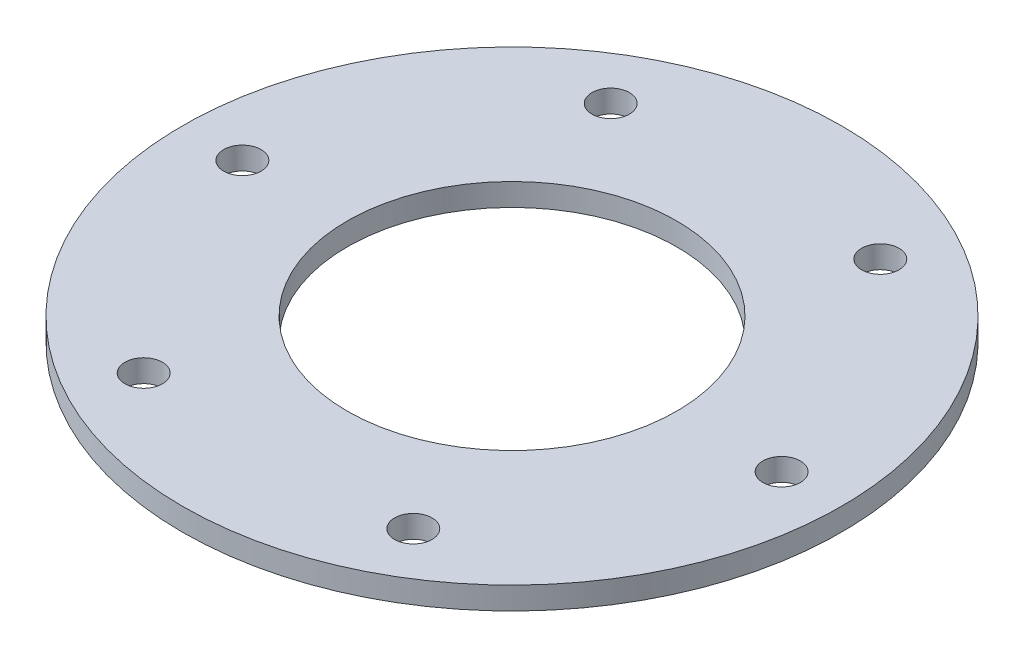
ISO-10303-21;
HEADER;
FILE_DESCRIPTION(('STEP AP214'),'2;1');
FILE_NAME('part.step','',(''),(''),'','','');
FILE_SCHEMA(('AUTOMOTIVE_DESIGN { 1 0 10303 214 1 1 1 1 }'));
ENDSEC;
DATA;
#1=APPLICATION_CONTEXT('core data for automotive mechanical design processes');
#2=APPLICATION_PROTOCOL_DEFINITION('international standard','automotive_design',2000,#1);
#3=PRODUCT_CONTEXT('',#1,'mechanical');
#4=PRODUCT('Part','Part','',(#3));
#5=PRODUCT_RELATED_PRODUCT_CATEGORY('part','',(#4));
#6=PRODUCT_DEFINITION_FORMATION('','',#4);
#7=PRODUCT_DEFINITION_CONTEXT('part definition',#1,'design');
#8=PRODUCT_DEFINITION('design','',#6,#7);
#9=PRODUCT_DEFINITION_SHAPE('','',#8);
#10=(LENGTH_UNIT() NAMED_UNIT(*) SI_UNIT(.MILLI.,.METRE.));
#11=(NAMED_UNIT(*) PLANE_ANGLE_UNIT() SI_UNIT($,.RADIAN.));
#12=(NAMED_UNIT(*) SI_UNIT($,.STERADIAN.) SOLID_ANGLE_UNIT());
#13=UNCERTAINTY_MEASURE_WITH_UNIT(LENGTH_MEASURE(1.E-05),#10,'distance_accuracy_value','');
#14=(GEOMETRIC_REPRESENTATION_CONTEXT(3) GLOBAL_UNCERTAINTY_ASSIGNED_CONTEXT((#13)) GLOBAL_UNIT_ASSIGNED_CONTEXT((#10,
#11,#12)) REPRESENTATION_CONTEXT('',''));
#15=CARTESIAN_POINT('',(0.,0.,0.));
#16=DIRECTION('',(0.,0.,1.));
#17=DIRECTION('',(1.,0.,0.));
#18=AXIS2_PLACEMENT_3D('',#15,#16,#17);
#19=CARTESIAN_POINT('',(-63.1888963600962,9.525,-128.089070315984));
#20=DIRECTION('',(0.,1.,0.));
#21=DIRECTION('',(0.,0.,1.));
#22=AXIS2_PLACEMENT_3D('',#19,#20,#21);
#23=PLANE('',#22);
#24=CARTESIAN_POINT('',(51.1111036399038,9.525,-128.089070315984));
#25=DIRECTION('',(0.,1.,0.));
#26=DIRECTION('',(0.,0.,1.));
#27=AXIS2_PLACEMENT_3D('',#24,#25,#26);
#28=CIRCLE('',#27,7.93749999999999);
#29=CARTESIAN_POINT('',(51.1111036399038,9.525,-120.151570315984));
#30=VERTEX_POINT('',#29);
#31=EDGE_CURVE('E79',#30,#30,#28,.T.);
#32=ORIENTED_EDGE('',*,*,#31,.F.);
#33=EDGE_LOOP('',(#32));
#34=FACE_BOUND('',#33,.T.);
#35=CARTESIAN_POINT('',(-6.03889636009618,9.525,-29.1023666634226));
#36=DIRECTION('',(0.,1.,0.));
#37=DIRECTION('',(0.,0.,1.));
#38=AXIS2_PLACEMENT_3D('',#35,#36,#37);
#39=CIRCLE('',#38,7.9375);
#40=CARTESIAN_POINT('',(-6.03889636009618,9.525,-21.1648666634226));
#41=VERTEX_POINT('',#40);
#42=EDGE_CURVE('E84',#41,#41,#39,.T.);
#43=ORIENTED_EDGE('',*,*,#42,.F.);
#44=EDGE_LOOP('',(#43));
#45=FACE_BOUND('',#44,.T.);
#46=CARTESIAN_POINT('',(-120.338896360096,9.525,-29.1023666634225));
#47=DIRECTION('',(0.,1.,0.));
#48=DIRECTION('',(0.,0.,1.));
#49=AXIS2_PLACEMENT_3D('',#46,#47,#48);
#50=CIRCLE('',#49,7.93749999999999);
#51=CARTESIAN_POINT('',(-120.338896360096,9.525,-21.1648666634225));
#52=VERTEX_POINT('',#51);
#53=EDGE_CURVE('E60',#52,#52,#50,.T.);
#54=ORIENTED_EDGE('',*,*,#53,.F.);
#55=EDGE_LOOP('',(#54));
#56=FACE_BOUND('',#55,.T.);
#57=CARTESIAN_POINT('',(-177.488896360096,9.525,-128.089070315984));
#58=DIRECTION('',(0.,1.,0.));
#59=DIRECTION('',(0.,0.,1.));
#60=AXIS2_PLACEMENT_3D('',#57,#58,#59);
#61=CIRCLE('',#60,7.93750000000001);
#62=CARTESIAN_POINT('',(-177.488896360096,9.525,-120.151570315984));
#63=VERTEX_POINT('',#62);
#64=EDGE_CURVE('E59',#63,#63,#61,.T.);
#65=ORIENTED_EDGE('',*,*,#64,.F.);
#66=EDGE_LOOP('',(#65));
#67=FACE_BOUND('',#66,.T.);
#68=CARTESIAN_POINT('',(-120.338896360096,9.525,-227.075773968545));
#69=DIRECTION('',(0.,1.,0.));
#70=DIRECTION('',(0.,0.,1.));
#71=AXIS2_PLACEMENT_3D('',#68,#69,#70);
#72=CIRCLE('',#71,7.93749999999999);
#73=CARTESIAN_POINT('',(-120.338896360096,9.525,-219.138273968545));
#74=VERTEX_POINT('',#73);
#75=EDGE_CURVE('E67',#74,#74,#72,.T.);
#76=ORIENTED_EDGE('',*,*,#75,.F.);
#77=EDGE_LOOP('',(#76));
#78=FACE_BOUND('',#77,.T.);
#79=CARTESIAN_POINT('',(-6.03889636009625,9.525,-227.075773968545));
#80=DIRECTION('',(0.,1.,0.));
#81=DIRECTION('',(0.,0.,1.));
#82=AXIS2_PLACEMENT_3D('',#79,#80,#81);
#83=CIRCLE('',#82,7.9375);
#84=CARTESIAN_POINT('',(-6.03889636009625,9.525,-219.138273968545));
#85=VERTEX_POINT('',#84);
#86=EDGE_CURVE('E73',#85,#85,#83,.T.);
#87=ORIENTED_EDGE('',*,*,#86,.F.);
#88=EDGE_LOOP('',(#87));
#89=FACE_BOUND('',#88,.T.);
#90=CARTESIAN_POINT('',(-63.1888963600962,9.525,-128.089070315984));
#91=DIRECTION('',(0.,1.,0.));
#92=DIRECTION('',(0.,0.,1.));
#93=AXIS2_PLACEMENT_3D('',#90,#91,#92);
#94=CIRCLE('',#93,139.7);
#95=CARTESIAN_POINT('',(-63.1888963600962,9.525,11.6109296840161));
#96=VERTEX_POINT('',#95);
#97=EDGE_CURVE('E10',#96,#96,#94,.T.);
#98=ORIENTED_EDGE('',*,*,#97,.T.);
#99=EDGE_LOOP('',(#98));
#100=FACE_BOUND('',#99,.T.);
#101=CARTESIAN_POINT('',(-63.1888963600962,9.525,-128.089070315984));
#102=DIRECTION('',(0.,1.,0.));
#103=DIRECTION('',(0.,0.,1.));
#104=AXIS2_PLACEMENT_3D('',#101,#102,#103);
#105=CIRCLE('',#104,69.85);
#106=CARTESIAN_POINT('',(-63.1888963600962,9.525,-58.2390703159839));
#107=VERTEX_POINT('',#106);
#108=EDGE_CURVE('E48',#107,#107,#105,.T.);
#109=ORIENTED_EDGE('',*,*,#108,.F.);
#110=EDGE_LOOP('',(#109));
#111=FACE_BOUND('',#110,.T.);
#112=ADVANCED_FACE('F37',(#34,#45,#56,#67,#78,#89,#100,#111),#23,.T.);
#113=CARTESIAN_POINT('',(-63.1888963600962,0.,-128.089070315984));
#114=DIRECTION('',(0.,1.,0.));
#115=DIRECTION('',(0.,0.,1.));
#116=AXIS2_PLACEMENT_3D('',#113,#114,#115);
#117=PLANE('',#116);
#118=CARTESIAN_POINT('',(51.1111036399038,0.,-128.089070315984));
#119=DIRECTION('',(0.,1.,0.));
#120=DIRECTION('',(0.,0.,1.));
#121=AXIS2_PLACEMENT_3D('',#118,#119,#120);
#122=CIRCLE('',#121,7.93749999999999);
#123=CARTESIAN_POINT('',(51.1111036399038,0.,-120.151570315984));
#124=VERTEX_POINT('',#123);
#125=EDGE_CURVE('E53',#124,#124,#122,.F.);
#126=ORIENTED_EDGE('',*,*,#125,.F.);
#127=EDGE_LOOP('',(#126));
#128=FACE_BOUND('',#127,.T.);
#129=CARTESIAN_POINT('',(-6.03889636009618,0.,-29.1023666634226));
#130=DIRECTION('',(0.,1.,0.));
#131=DIRECTION('',(0.,0.,1.));
#132=AXIS2_PLACEMENT_3D('',#129,#130,#131);
#133=CIRCLE('',#132,7.9375);
#134=CARTESIAN_POINT('',(-6.03889636009618,0.,-21.1648666634226));
#135=VERTEX_POINT('',#134);
#136=EDGE_CURVE('E63',#135,#135,#133,.F.);
#137=ORIENTED_EDGE('',*,*,#136,.F.);
#138=EDGE_LOOP('',(#137));
#139=FACE_BOUND('',#138,.T.);
#140=CARTESIAN_POINT('',(-120.338896360096,0.,-29.1023666634225));
#141=DIRECTION('',(0.,1.,0.));
#142=DIRECTION('',(0.,0.,1.));
#143=AXIS2_PLACEMENT_3D('',#140,#141,#142);
#144=CIRCLE('',#143,7.93749999999999);
#145=CARTESIAN_POINT('',(-120.338896360096,0.,-21.1648666634225));
#146=VERTEX_POINT('',#145);
#147=EDGE_CURVE('E56',#146,#146,#144,.F.);
#148=ORIENTED_EDGE('',*,*,#147,.F.);
#149=EDGE_LOOP('',(#148));
#150=FACE_BOUND('',#149,.T.);
#151=CARTESIAN_POINT('',(-177.488896360096,0.,-128.089070315984));
#152=DIRECTION('',(0.,1.,0.));
#153=DIRECTION('',(0.,0.,1.));
#154=AXIS2_PLACEMENT_3D('',#151,#152,#153);
#155=CIRCLE('',#154,7.93750000000001);
#156=CARTESIAN_POINT('',(-177.488896360096,0.,-120.151570315984));
#157=VERTEX_POINT('',#156);
#158=EDGE_CURVE('E64',#157,#157,#155,.F.);
#159=ORIENTED_EDGE('',*,*,#158,.F.);
#160=EDGE_LOOP('',(#159));
#161=FACE_BOUND('',#160,.T.);
#162=CARTESIAN_POINT('',(-120.338896360096,0.,-227.075773968545));
#163=DIRECTION('',(0.,1.,0.));
#164=DIRECTION('',(0.,0.,1.));
#165=AXIS2_PLACEMENT_3D('',#162,#163,#164);
#166=CIRCLE('',#165,7.93749999999999);
#167=CARTESIAN_POINT('',(-120.338896360096,0.,-219.138273968545));
#168=VERTEX_POINT('',#167);
#169=EDGE_CURVE('E70',#168,#168,#166,.F.);
#170=ORIENTED_EDGE('',*,*,#169,.F.);
#171=EDGE_LOOP('',(#170));
#172=FACE_BOUND('',#171,.T.);
#173=CARTESIAN_POINT('',(-6.03889636009625,0.,-227.075773968545));
#174=DIRECTION('',(0.,1.,0.));
#175=DIRECTION('',(0.,0.,1.));
#176=AXIS2_PLACEMENT_3D('',#173,#174,#175);
#177=CIRCLE('',#176,7.9375);
#178=CARTESIAN_POINT('',(-6.03889636009625,0.,-219.138273968545));
#179=VERTEX_POINT('',#178);
#180=EDGE_CURVE('E76',#179,#179,#177,.F.);
#181=ORIENTED_EDGE('',*,*,#180,.F.);
#182=EDGE_LOOP('',(#181));
#183=FACE_BOUND('',#182,.T.);
#184=CARTESIAN_POINT('',(-63.1888963600962,0.,-128.089070315984));
#185=DIRECTION('',(0.,1.,0.));
#186=DIRECTION('',(0.,0.,1.));
#187=AXIS2_PLACEMENT_3D('',#184,#185,#186);
#188=CIRCLE('',#187,139.7);
#189=CARTESIAN_POINT('',(-63.1888963600962,0.,11.6109296840161));
#190=VERTEX_POINT('',#189);
#191=EDGE_CURVE('E41',#190,#190,#188,.T.);
#192=ORIENTED_EDGE('',*,*,#191,.F.);
#193=EDGE_LOOP('',(#192));
#194=FACE_BOUND('',#193,.T.);
#195=CARTESIAN_POINT('',(-63.1888963600962,0.,-128.089070315984));
#196=DIRECTION('',(0.,1.,0.));
#197=DIRECTION('',(0.,0.,1.));
#198=AXIS2_PLACEMENT_3D('',#195,#196,#197);
#199=CIRCLE('',#198,69.85);
#200=CARTESIAN_POINT('',(-63.1888963600962,0.,-58.2390703159839));
#201=VERTEX_POINT('',#200);
#202=EDGE_CURVE('E50',#201,#201,#199,.T.);
#203=ORIENTED_EDGE('',*,*,#202,.T.);
#204=EDGE_LOOP('',(#203));
#205=FACE_BOUND('',#204,.T.);
#206=ADVANCED_FACE('F97',(#128,#139,#150,#161,#172,#183,#194,#205),#117,.F.);
#207=CARTESIAN_POINT('',(-63.1888963600962,9.525,-128.089070315984));
#208=DIRECTION('',(0.,-1.,0.));
#209=DIRECTION('',(0.,0.,-1.));
#210=AXIS2_PLACEMENT_3D('',#207,#208,#209);
#211=CYLINDRICAL_SURFACE('',#210,139.7);
#212=ORIENTED_EDGE('',*,*,#97,.F.);
#213=EDGE_LOOP('',(#212));
#214=FACE_BOUND('',#213,.T.);
#215=ORIENTED_EDGE('',*,*,#191,.T.);
#216=EDGE_LOOP('',(#215));
#217=FACE_BOUND('',#216,.T.);
#218=ADVANCED_FACE('F39',(#214,#217),#211,.T.);
#219=CARTESIAN_POINT('',(-63.1888963600962,9.525,-128.089070315984));
#220=DIRECTION('',(0.,-1.,0.));
#221=DIRECTION('',(0.,0.,-1.));
#222=AXIS2_PLACEMENT_3D('',#219,#220,#221);
#223=CYLINDRICAL_SURFACE('',#222,69.85);
#224=ORIENTED_EDGE('',*,*,#108,.T.);
#225=EDGE_LOOP('',(#224));
#226=FACE_BOUND('',#225,.T.);
#227=ORIENTED_EDGE('',*,*,#202,.F.);
#228=EDGE_LOOP('',(#227));
#229=FACE_BOUND('',#228,.T.);
#230=ADVANCED_FACE('F111',(#226,#229),#223,.F.);
#231=CARTESIAN_POINT('',(-6.03889636009625,-0.000999999999999265,-227.075773968545));
#232=DIRECTION('',(0.,1.,0.));
#233=DIRECTION('',(0.,0.,1.));
#234=AXIS2_PLACEMENT_3D('',#231,#232,#233);
#235=CYLINDRICAL_SURFACE('',#234,7.9375);
#236=ORIENTED_EDGE('',*,*,#86,.T.);
#237=EDGE_LOOP('',(#236));
#238=FACE_BOUND('',#237,.T.);
#239=ORIENTED_EDGE('',*,*,#180,.T.);
#240=EDGE_LOOP('',(#239));
#241=FACE_BOUND('',#240,.T.);
#242=ADVANCED_FACE('F114',(#238,#241),#235,.F.);
#243=CARTESIAN_POINT('',(-120.338896360096,-0.000999999999999265,-227.075773968545));
#244=DIRECTION('',(0.,1.,0.));
#245=DIRECTION('',(0.,0.,1.));
#246=AXIS2_PLACEMENT_3D('',#243,#244,#245);
#247=CYLINDRICAL_SURFACE('',#246,7.93749999999999);
#248=ORIENTED_EDGE('',*,*,#75,.T.);
#249=EDGE_LOOP('',(#248));
#250=FACE_BOUND('',#249,.T.);
#251=ORIENTED_EDGE('',*,*,#169,.T.);
#252=EDGE_LOOP('',(#251));
#253=FACE_BOUND('',#252,.T.);
#254=ADVANCED_FACE('F135',(#250,#253),#247,.F.);
#255=CARTESIAN_POINT('',(-177.488896360096,-0.000999999999999265,-128.089070315984));
#256=DIRECTION('',(0.,1.,0.));
#257=DIRECTION('',(0.,0.,1.));
#258=AXIS2_PLACEMENT_3D('',#255,#256,#257);
#259=CYLINDRICAL_SURFACE('',#258,7.93750000000001);
#260=ORIENTED_EDGE('',*,*,#64,.T.);
#261=EDGE_LOOP('',(#260));
#262=FACE_BOUND('',#261,.T.);
#263=ORIENTED_EDGE('',*,*,#158,.T.);
#264=EDGE_LOOP('',(#263));
#265=FACE_BOUND('',#264,.T.);
#266=ADVANCED_FACE('F131',(#262,#265),#259,.F.);
#267=CARTESIAN_POINT('',(-120.338896360096,-0.000999999999999265,-29.1023666634225));
#268=DIRECTION('',(0.,1.,0.));
#269=DIRECTION('',(0.,0.,1.));
#270=AXIS2_PLACEMENT_3D('',#267,#268,#269);
#271=CYLINDRICAL_SURFACE('',#270,7.93749999999999);
#272=ORIENTED_EDGE('',*,*,#53,.T.);
#273=EDGE_LOOP('',(#272));
#274=FACE_BOUND('',#273,.T.);
#275=ORIENTED_EDGE('',*,*,#147,.T.);
#276=EDGE_LOOP('',(#275));
#277=FACE_BOUND('',#276,.T.);
#278=ADVANCED_FACE('F127',(#274,#277),#271,.F.);
#279=CARTESIAN_POINT('',(-6.03889636009618,-0.000999999999999265,-29.1023666634226));
#280=DIRECTION('',(0.,1.,0.));
#281=DIRECTION('',(0.,0.,1.));
#282=AXIS2_PLACEMENT_3D('',#279,#280,#281);
#283=CYLINDRICAL_SURFACE('',#282,7.9375);
#284=ORIENTED_EDGE('',*,*,#42,.T.);
#285=EDGE_LOOP('',(#284));
#286=FACE_BOUND('',#285,.T.);
#287=ORIENTED_EDGE('',*,*,#136,.T.);
#288=EDGE_LOOP('',(#287));
#289=FACE_BOUND('',#288,.T.);
#290=ADVANCED_FACE('F130',(#286,#289),#283,.F.);
#291=CARTESIAN_POINT('',(51.1111036399038,-0.000999999999999265,-128.089070315984));
#292=DIRECTION('',(0.,1.,0.));
#293=DIRECTION('',(0.,0.,1.));
#294=AXIS2_PLACEMENT_3D('',#291,#292,#293);
#295=CYLINDRICAL_SURFACE('',#294,7.93749999999999);
#296=ORIENTED_EDGE('',*,*,#31,.T.);
#297=EDGE_LOOP('',(#296));
#298=FACE_BOUND('',#297,.T.);
#299=ORIENTED_EDGE('',*,*,#125,.T.);
#300=EDGE_LOOP('',(#299));
#301=FACE_BOUND('',#300,.T.);
#302=ADVANCED_FACE('F92',(#298,#301),#295,.F.);
#303=CLOSED_SHELL('',(#112,#206,#218,#230,#242,#254,#266,#278,#290,#302));
#304=MANIFOLD_SOLID_BREP('B2',#303);
#305=ADVANCED_BREP_SHAPE_REPRESENTATION('',(#18,#304),#14);
#306=SHAPE_DEFINITION_REPRESENTATION(#9,#305);
ENDSEC;
END-ISO-10303-21;
